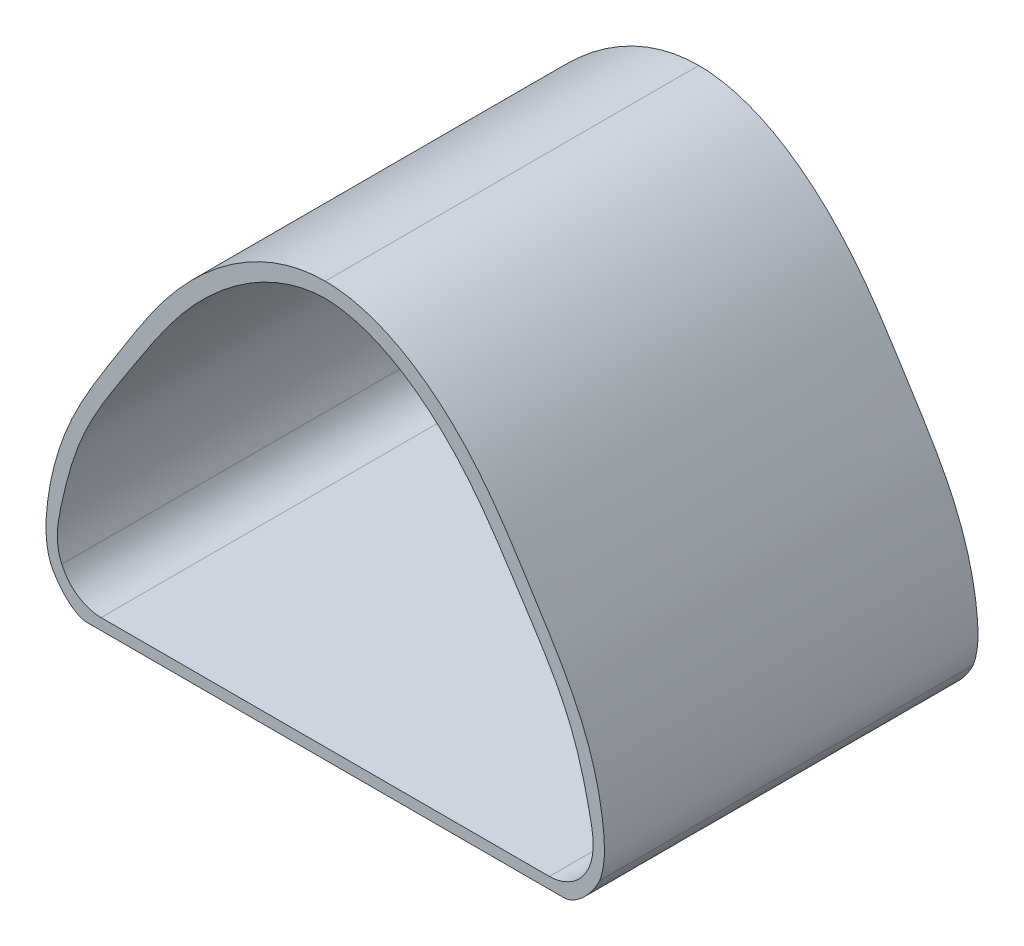
ISO-10303-21;
HEADER;
FILE_DESCRIPTION(('STEP AP214'),'2;1');
FILE_NAME('part.step','',(''),(''),'','','');
FILE_SCHEMA(('AUTOMOTIVE_DESIGN { 1 0 10303 214 1 1 1 1 }'));
ENDSEC;
DATA;
#1=APPLICATION_CONTEXT('core data for automotive mechanical design processes');
#2=APPLICATION_PROTOCOL_DEFINITION('international standard','automotive_design',2000,#1);
#3=PRODUCT_CONTEXT('',#1,'mechanical');
#4=PRODUCT('Part','Part','',(#3));
#5=PRODUCT_RELATED_PRODUCT_CATEGORY('part','',(#4));
#6=PRODUCT_DEFINITION_FORMATION('','',#4);
#7=PRODUCT_DEFINITION_CONTEXT('part definition',#1,'design');
#8=PRODUCT_DEFINITION('design','',#6,#7);
#9=PRODUCT_DEFINITION_SHAPE('','',#8);
#10=(LENGTH_UNIT() NAMED_UNIT(*) SI_UNIT(.MILLI.,.METRE.));
#11=(NAMED_UNIT(*) PLANE_ANGLE_UNIT() SI_UNIT($,.RADIAN.));
#12=(NAMED_UNIT(*) SI_UNIT($,.STERADIAN.) SOLID_ANGLE_UNIT());
#13=UNCERTAINTY_MEASURE_WITH_UNIT(LENGTH_MEASURE(1.E-05),#10,'distance_accuracy_value','');
#14=(GEOMETRIC_REPRESENTATION_CONTEXT(3) GLOBAL_UNCERTAINTY_ASSIGNED_CONTEXT((#13)) GLOBAL_UNIT_ASSIGNED_CONTEXT((#10,
#11,#12)) REPRESENTATION_CONTEXT('',''));
#15=CARTESIAN_POINT('',(0.,0.,0.));
#16=DIRECTION('',(0.,0.,1.));
#17=DIRECTION('',(1.,0.,0.));
#18=AXIS2_PLACEMENT_3D('',#15,#16,#17);
#19=CARTESIAN_POINT('',(-26.2866131746195,14.0454252533659,50.));
#20=DIRECTION('',(0.,0.,-1.));
#21=DIRECTION('',(-1.,0.,0.));
#22=AXIS2_PLACEMENT_3D('',#19,#20,#21);
#23=PLANE('',#22);
#24=CARTESIAN_POINT('',(0.,34.,50.));
#25=CARTESIAN_POINT('',(-7.55591327936916,34.0116022680808,50.));
#26=CARTESIAN_POINT('',(-18.9599448917895,25.9336197892861,50.));
#27=CARTESIAN_POINT('',(-27.4107680639639,12.1589549208056,50.));
#28=CARTESIAN_POINT('',(-34.5056174863227,1.23156958461363,50.));
#29=CARTESIAN_POINT('',(-37.3685284127436,-8.74251736737803,50.));
#30=CARTESIAN_POINT('',(-37.5154890228837,-15.1166862360437,50.));
#31=CARTESIAN_POINT('',(-36.7339095421751,-17.1293033334891,50.));
#32=B_SPLINE_CURVE_WITH_KNOTS('',3,(#24,#25,#26,#27,#28,#29,#30,#31),.UNSPECIFIED.,.F.,.F.,(4,1,
1,1,1,4),(0.,0.330857753427656,0.539322828956454,0.730827311197381,0.902654757311437,1.),.UNSPECIFIED.);
#33=CARTESIAN_POINT('',(0.,34.,50.));
#34=VERTEX_POINT('',#33);
#35=CARTESIAN_POINT('',(-36.7339095421751,-17.1293033334891,50.));
#36=VERTEX_POINT('',#35);
#37=EDGE_CURVE('E230',#34,#36,#32,.T.);
#38=ORIENTED_EDGE('',*,*,#37,.T.);
#39=CARTESIAN_POINT('',(-36.7339095421751,-17.1293033334891,50.));
#40=CARTESIAN_POINT('',(-36.4427084578611,-17.7892932581863,50.));
#41=CARTESIAN_POINT('',(-35.0930030724469,-20.0354093422505,50.));
#42=CARTESIAN_POINT('',(-32.8599028306378,-21.4830955631931,50.));
#43=CARTESIAN_POINT('',(-32.,-21.5,50.));
#44=B_SPLINE_CURVE_WITH_KNOTS('',3,(#39,#40,#41,#42,#43),.UNSPECIFIED.,.F.,.F.,(4,1,4),(0.,
0.489167663006453,1.),.UNSPECIFIED.);
#45=CARTESIAN_POINT('',(-32.,-21.5,50.));
#46=VERTEX_POINT('',#45);
#47=EDGE_CURVE('E268',#36,#46,#44,.T.);
#48=ORIENTED_EDGE('',*,*,#47,.T.);
#49=DIRECTION('',(1.,0.,0.));
#50=VECTOR('',#49,1.);
#51=CARTESIAN_POINT('',(-32.,-21.5,50.));
#52=LINE('',#51,#50);
#53=CARTESIAN_POINT('',(32.,-21.5,50.));
#54=VERTEX_POINT('',#53);
#55=EDGE_CURVE('E252',#46,#54,#52,.T.);
#56=ORIENTED_EDGE('',*,*,#55,.T.);
#57=CARTESIAN_POINT('',(32.,-21.5,50.));
#58=CARTESIAN_POINT('',(32.8599028306378,-21.4830955631931,50.));
#59=CARTESIAN_POINT('',(35.0930030724469,-20.0354093422505,50.));
#60=CARTESIAN_POINT('',(36.4427084578611,-17.7892932581863,50.));
#61=CARTESIAN_POINT('',(36.7339095421751,-17.1293033334891,50.));
#62=B_SPLINE_CURVE_WITH_KNOTS('',3,(#57,#58,#59,#60,#61),.UNSPECIFIED.,.F.,.F.,(4,1,4),(0.,
0.510832336993547,1.),.UNSPECIFIED.);
#63=CARTESIAN_POINT('',(36.7339095421751,-17.1293033334891,50.));
#64=VERTEX_POINT('',#63);
#65=EDGE_CURVE('E190',#54,#64,#62,.T.);
#66=ORIENTED_EDGE('',*,*,#65,.T.);
#67=CARTESIAN_POINT('',(36.7339095421751,-17.1293033334891,50.));
#68=CARTESIAN_POINT('',(37.5154890228837,-15.1166862360437,50.));
#69=CARTESIAN_POINT('',(37.3685284127436,-8.74251736737802,50.));
#70=CARTESIAN_POINT('',(34.5056174863227,1.23156958461364,50.));
#71=CARTESIAN_POINT('',(27.4107680639639,12.1589549208056,50.));
#72=CARTESIAN_POINT('',(18.9599448917895,25.933619789286,50.));
#73=CARTESIAN_POINT('',(7.55591327936915,34.0116022680808,50.));
#74=CARTESIAN_POINT('',(0.,34.,50.));
#75=B_SPLINE_CURVE_WITH_KNOTS('',3,(#67,#68,#69,#70,#71,#72,#73,#74),.UNSPECIFIED.,.F.,.F.,(4,1,
1,1,1,4),(0.,0.0973452426885626,0.269172688802619,0.460677171043546,0.669142246572344,1.),.UNSPECIFIED.);
#76=EDGE_CURVE('E183',#64,#34,#75,.T.);
#77=ORIENTED_EDGE('',*,*,#76,.T.);
#78=EDGE_LOOP('',(#38,#48,#56,#66,#77));
#79=FACE_BOUND('',#78,.T.);
#80=CARTESIAN_POINT('',(35.2584368437434,-16.4412791148118,50.));
#81=CARTESIAN_POINT('',(36.2300611856856,-14.2120162556952,50.));
#82=CARTESIAN_POINT('',(35.2635909123545,-8.86453883683733,50.));
#83=CARTESIAN_POINT('',(32.7911731615511,0.606888672938725,50.));
#84=CARTESIAN_POINT('',(25.7176322990285,11.1374464392121,50.));
#85=CARTESIAN_POINT('',(17.5035133605746,24.3306932764224,50.));
#86=CARTESIAN_POINT('',(6.52553134181208,31.9035956706368,50.));
#87=CARTESIAN_POINT('',(0.,32.,50.));
#88=B_SPLINE_CURVE_WITH_KNOTS('',3,(#80,#81,#82,#83,#84,#85,#86,#87),.UNSPECIFIED.,.F.,.F.,(4,1,
1,1,1,4),(0.,0.101815778200956,0.254593468675808,0.456472378289915,0.689238128462499,1.),.UNSPECIFIED.);
#89=CARTESIAN_POINT('',(35.2584368437434,-16.4412791148118,50.));
#90=VERTEX_POINT('',#89);
#91=CARTESIAN_POINT('',(0.,32.,50.));
#92=VERTEX_POINT('',#91);
#93=EDGE_CURVE('E118',#90,#92,#88,.T.);
#94=ORIENTED_EDGE('',*,*,#93,.F.);
#95=CARTESIAN_POINT('',(30.,-20.,50.));
#96=CARTESIAN_POINT('',(31.1853546864803,-20.0293160233538,50.));
#97=CARTESIAN_POINT('',(33.6905561455173,-19.1425610901067,50.));
#98=CARTESIAN_POINT('',(34.9964434209078,-17.0209088515704,50.));
#99=CARTESIAN_POINT('',(35.2584368437434,-16.4412791148118,50.));
#100=B_SPLINE_CURVE_WITH_KNOTS('',3,(#95,#96,#97,#98,#99),.UNSPECIFIED.,.F.,.F.,(4,1,4),(0.,
0.640099303613698,1.),.UNSPECIFIED.);
#101=CARTESIAN_POINT('',(30.,-20.,50.));
#102=VERTEX_POINT('',#101);
#103=EDGE_CURVE('E376',#102,#90,#100,.T.);
#104=ORIENTED_EDGE('',*,*,#103,.F.);
#105=DIRECTION('',(1.,0.,0.));
#106=VECTOR('',#105,1.);
#107=CARTESIAN_POINT('',(-30.,-20.,50.));
#108=LINE('',#107,#106);
#109=CARTESIAN_POINT('',(-30.,-20.,50.));
#110=VERTEX_POINT('',#109);
#111=EDGE_CURVE('E145',#110,#102,#108,.T.);
#112=ORIENTED_EDGE('',*,*,#111,.F.);
#113=CARTESIAN_POINT('',(-35.2584368437434,-16.4412791148118,50.));
#114=CARTESIAN_POINT('',(-34.9964434209078,-17.0209088515704,50.));
#115=CARTESIAN_POINT('',(-33.6905561455173,-19.1425610901067,50.));
#116=CARTESIAN_POINT('',(-31.1853546864803,-20.0293160233538,50.));
#117=CARTESIAN_POINT('',(-30.,-20.,50.));
#118=B_SPLINE_CURVE_WITH_KNOTS('',3,(#113,#114,#115,#116,#117),.UNSPECIFIED.,.F.,.F.,(4,1,4),
(0.,0.359900696386302,1.),.UNSPECIFIED.);
#119=CARTESIAN_POINT('',(-35.2584368437434,-16.4412791148118,50.));
#120=VERTEX_POINT('',#119);
#121=EDGE_CURVE('E141',#120,#110,#118,.T.);
#122=ORIENTED_EDGE('',*,*,#121,.F.);
#123=CARTESIAN_POINT('',(0.,32.,50.));
#124=CARTESIAN_POINT('',(-6.52553134181209,31.9035956706368,50.));
#125=CARTESIAN_POINT('',(-17.5035133605746,24.3306932764224,50.));
#126=CARTESIAN_POINT('',(-25.7176322990285,11.1374464392121,50.));
#127=CARTESIAN_POINT('',(-32.7911731615511,0.60688867293871,50.));
#128=CARTESIAN_POINT('',(-35.2635909123545,-8.86453883683735,50.));
#129=CARTESIAN_POINT('',(-36.2300611856856,-14.2120162556952,50.));
#130=CARTESIAN_POINT('',(-35.2584368437434,-16.4412791148118,50.));
#131=B_SPLINE_CURVE_WITH_KNOTS('',3,(#123,#124,#125,#126,#127,#128,#129,#130),.UNSPECIFIED.,.F.,
.F.,(4,1,1,1,1,4),(0.,0.310761871537501,0.543527621710084,0.745406531324192,0.898184221799044,
1.),.UNSPECIFIED.);
#132=EDGE_CURVE('E127',#92,#120,#131,.T.);
#133=ORIENTED_EDGE('',*,*,#132,.F.);
#134=EDGE_LOOP('',(#94,#104,#112,#122,#133));
#135=FACE_BOUND('',#134,.T.);
#136=ADVANCED_FACE('F39',(#79,#135),#23,.F.);
#137=CARTESIAN_POINT('',(-26.2866131746195,14.0454252533659,0.));
#138=DIRECTION('',(0.,0.,-1.));
#139=DIRECTION('',(-1.,0.,0.));
#140=AXIS2_PLACEMENT_3D('',#137,#138,#139);
#141=PLANE('',#140);
#142=CARTESIAN_POINT('',(0.,34.,0.));
#143=CARTESIAN_POINT('',(-7.55591327936916,34.0116022680808,0.));
#144=CARTESIAN_POINT('',(-18.9599448917895,25.9336197892861,0.));
#145=CARTESIAN_POINT('',(-27.4107680639639,12.1589549208056,0.));
#146=CARTESIAN_POINT('',(-34.5056174863227,1.23156958461363,0.));
#147=CARTESIAN_POINT('',(-37.3685284127436,-8.74251736737803,0.));
#148=CARTESIAN_POINT('',(-37.5154890228837,-15.1166862360437,0.));
#149=CARTESIAN_POINT('',(-36.7339095421751,-17.1293033334891,0.));
#150=B_SPLINE_CURVE_WITH_KNOTS('',3,(#142,#143,#144,#145,#146,#147,#148,#149),.UNSPECIFIED.,.F.,
.F.,(4,1,1,1,1,4),(0.,0.330857753427656,0.539322828956454,0.730827311197381,0.902654757311437,
1.),.UNSPECIFIED.);
#151=CARTESIAN_POINT('',(0.,34.,0.));
#152=VERTEX_POINT('',#151);
#153=CARTESIAN_POINT('',(-36.7339095421751,-17.1293033334891,0.));
#154=VERTEX_POINT('',#153);
#155=EDGE_CURVE('E136',#152,#154,#150,.T.);
#156=ORIENTED_EDGE('',*,*,#155,.F.);
#157=CARTESIAN_POINT('',(36.7339095421751,-17.1293033334891,0.));
#158=CARTESIAN_POINT('',(37.5154890228837,-15.1166862360437,0.));
#159=CARTESIAN_POINT('',(37.3685284127436,-8.74251736737802,0.));
#160=CARTESIAN_POINT('',(34.5056174863227,1.23156958461364,0.));
#161=CARTESIAN_POINT('',(27.4107680639639,12.1589549208056,0.));
#162=CARTESIAN_POINT('',(18.9599448917895,25.933619789286,0.));
#163=CARTESIAN_POINT('',(7.55591327936915,34.0116022680808,0.));
#164=CARTESIAN_POINT('',(0.,34.,0.));
#165=B_SPLINE_CURVE_WITH_KNOTS('',3,(#157,#158,#159,#160,#161,#162,#163,#164),.UNSPECIFIED.,.F.,
.F.,(4,1,1,1,1,4),(0.,0.0973452426885626,0.269172688802619,0.460677171043546,0.669142246572344,
1.),.UNSPECIFIED.);
#166=CARTESIAN_POINT('',(36.7339095421751,-17.1293033334891,0.));
#167=VERTEX_POINT('',#166);
#168=EDGE_CURVE('E222',#167,#152,#165,.T.);
#169=ORIENTED_EDGE('',*,*,#168,.F.);
#170=CARTESIAN_POINT('',(32.,-21.5,0.));
#171=CARTESIAN_POINT('',(32.8599028306378,-21.4830955631931,0.));
#172=CARTESIAN_POINT('',(35.0930030724469,-20.0354093422505,0.));
#173=CARTESIAN_POINT('',(36.4427084578611,-17.7892932581863,0.));
#174=CARTESIAN_POINT('',(36.7339095421751,-17.1293033334891,0.));
#175=B_SPLINE_CURVE_WITH_KNOTS('',3,(#170,#171,#172,#173,#174),.UNSPECIFIED.,.F.,.F.,(4,1,4),
(0.,0.510832336993547,1.),.UNSPECIFIED.);
#176=CARTESIAN_POINT('',(32.,-21.5,0.));
#177=VERTEX_POINT('',#176);
#178=EDGE_CURVE('E217',#177,#167,#175,.T.);
#179=ORIENTED_EDGE('',*,*,#178,.F.);
#180=DIRECTION('',(1.,0.,0.));
#181=VECTOR('',#180,1.);
#182=CARTESIAN_POINT('',(-32.,-21.5,0.));
#183=LINE('',#182,#181);
#184=CARTESIAN_POINT('',(-32.,-21.5,0.));
#185=VERTEX_POINT('',#184);
#186=EDGE_CURVE('E211',#185,#177,#183,.T.);
#187=ORIENTED_EDGE('',*,*,#186,.F.);
#188=CARTESIAN_POINT('',(-36.7339095421751,-17.1293033334891,0.));
#189=CARTESIAN_POINT('',(-36.4427084578611,-17.7892932581863,0.));
#190=CARTESIAN_POINT('',(-35.0930030724469,-20.0354093422505,0.));
#191=CARTESIAN_POINT('',(-32.8599028306378,-21.4830955631931,0.));
#192=CARTESIAN_POINT('',(-32.,-21.5,0.));
#193=B_SPLINE_CURVE_WITH_KNOTS('',3,(#188,#189,#190,#191,#192),.UNSPECIFIED.,.F.,.F.,(4,1,4),
(0.,0.489167663006453,1.),.UNSPECIFIED.);
#194=EDGE_CURVE('E203',#154,#185,#193,.T.);
#195=ORIENTED_EDGE('',*,*,#194,.F.);
#196=EDGE_LOOP('',(#156,#169,#179,#187,#195));
#197=FACE_BOUND('',#196,.T.);
#198=CARTESIAN_POINT('',(30.,-20.,0.));
#199=CARTESIAN_POINT('',(31.1853546864803,-20.0293160233538,0.));
#200=CARTESIAN_POINT('',(33.6905561455173,-19.1425610901067,0.));
#201=CARTESIAN_POINT('',(34.9964434209078,-17.0209088515704,0.));
#202=CARTESIAN_POINT('',(35.2584368437434,-16.4412791148118,0.));
#203=B_SPLINE_CURVE_WITH_KNOTS('',3,(#198,#199,#200,#201,#202),.UNSPECIFIED.,.F.,.F.,(4,1,4),
(0.,0.640099303613698,1.),.UNSPECIFIED.);
#204=CARTESIAN_POINT('',(30.,-20.,0.));
#205=VERTEX_POINT('',#204);
#206=CARTESIAN_POINT('',(35.2584368437434,-16.4412791148118,0.));
#207=VERTEX_POINT('',#206);
#208=EDGE_CURVE('E128',#205,#207,#203,.T.);
#209=ORIENTED_EDGE('',*,*,#208,.T.);
#210=CARTESIAN_POINT('',(35.2584368437434,-16.4412791148118,0.));
#211=CARTESIAN_POINT('',(36.2300611856856,-14.2120162556952,0.));
#212=CARTESIAN_POINT('',(35.2635909123545,-8.86453883683733,0.));
#213=CARTESIAN_POINT('',(32.7911731615511,0.606888672938725,0.));
#214=CARTESIAN_POINT('',(25.7176322990285,11.1374464392121,0.));
#215=CARTESIAN_POINT('',(17.5035133605746,24.3306932764224,0.));
#216=CARTESIAN_POINT('',(6.52553134181208,31.9035956706368,0.));
#217=CARTESIAN_POINT('',(0.,32.,0.));
#218=B_SPLINE_CURVE_WITH_KNOTS('',3,(#210,#211,#212,#213,#214,#215,#216,#217),.UNSPECIFIED.,.F.,
.F.,(4,1,1,1,1,4),(0.,0.101815778200956,0.254593468675808,0.456472378289915,0.689238128462499,
1.),.UNSPECIFIED.);
#219=CARTESIAN_POINT('',(0.,32.,0.));
#220=VERTEX_POINT('',#219);
#221=EDGE_CURVE('E64',#207,#220,#218,.T.);
#222=ORIENTED_EDGE('',*,*,#221,.T.);
#223=CARTESIAN_POINT('',(0.,32.,0.));
#224=CARTESIAN_POINT('',(-6.52553134181209,31.9035956706368,0.));
#225=CARTESIAN_POINT('',(-17.5035133605746,24.3306932764224,0.));
#226=CARTESIAN_POINT('',(-25.7176322990285,11.1374464392121,0.));
#227=CARTESIAN_POINT('',(-32.7911731615511,0.60688867293871,0.));
#228=CARTESIAN_POINT('',(-35.2635909123545,-8.86453883683735,0.));
#229=CARTESIAN_POINT('',(-36.2300611856856,-14.2120162556952,0.));
#230=CARTESIAN_POINT('',(-35.2584368437434,-16.4412791148118,0.));
#231=B_SPLINE_CURVE_WITH_KNOTS('',3,(#223,#224,#225,#226,#227,#228,#229,#230),.UNSPECIFIED.,.F.,
.F.,(4,1,1,1,1,4),(0.,0.310761871537501,0.543527621710084,0.745406531324192,0.898184221799044,
1.),.UNSPECIFIED.);
#232=CARTESIAN_POINT('',(-35.2584368437434,-16.4412791148118,0.));
#233=VERTEX_POINT('',#232);
#234=EDGE_CURVE('E134',#220,#233,#231,.T.);
#235=ORIENTED_EDGE('',*,*,#234,.T.);
#236=CARTESIAN_POINT('',(-35.2584368437434,-16.4412791148118,0.));
#237=CARTESIAN_POINT('',(-34.9964434209078,-17.0209088515704,0.));
#238=CARTESIAN_POINT('',(-33.6905561455173,-19.1425610901067,0.));
#239=CARTESIAN_POINT('',(-31.1853546864803,-20.0293160233538,0.));
#240=CARTESIAN_POINT('',(-30.,-20.,0.));
#241=B_SPLINE_CURVE_WITH_KNOTS('',3,(#236,#237,#238,#239,#240),.UNSPECIFIED.,.F.,.F.,(4,1,4),
(0.,0.359900696386302,1.),.UNSPECIFIED.);
#242=CARTESIAN_POINT('',(-30.,-20.,0.));
#243=VERTEX_POINT('',#242);
#244=EDGE_CURVE('E399',#233,#243,#241,.T.);
#245=ORIENTED_EDGE('',*,*,#244,.T.);
#246=DIRECTION('',(1.,0.,0.));
#247=VECTOR('',#246,1.);
#248=CARTESIAN_POINT('',(-30.,-20.,0.));
#249=LINE('',#248,#247);
#250=EDGE_CURVE('E408',#243,#205,#249,.T.);
#251=ORIENTED_EDGE('',*,*,#250,.T.);
#252=EDGE_LOOP('',(#209,#222,#235,#245,#251));
#253=FACE_BOUND('',#252,.T.);
#254=ADVANCED_FACE('F171',(#197,#253),#141,.T.);
#255=DIRECTION('',(0.,0.,-1.));
#256=VECTOR('',#255,1.);
#257=SURFACE_OF_LINEAR_EXTRUSION('',#32,#256);
#258=ORIENTED_EDGE('',*,*,#155,.T.);
#259=DIRECTION('',(0.,0.,-1.));
#260=VECTOR('',#259,1.);
#261=CARTESIAN_POINT('',(-36.7339095421751,-17.1293033334891,50.));
#262=LINE('',#261,#260);
#263=EDGE_CURVE('E11',#36,#154,#262,.T.);
#264=ORIENTED_EDGE('',*,*,#263,.F.);
#265=ORIENTED_EDGE('',*,*,#37,.F.);
#266=DIRECTION('',(0.,0.,-1.));
#267=VECTOR('',#266,1.);
#268=CARTESIAN_POINT('',(0.,34.,50.));
#269=LINE('',#268,#267);
#270=EDGE_CURVE('E189',#34,#152,#269,.T.);
#271=ORIENTED_EDGE('',*,*,#270,.T.);
#272=EDGE_LOOP('',(#258,#264,#265,#271));
#273=FACE_BOUND('',#272,.T.);
#274=ADVANCED_FACE('F41',(#273),#257,.F.);
#275=DIRECTION('',(0.,0.,-1.));
#276=VECTOR('',#275,1.);
#277=SURFACE_OF_LINEAR_EXTRUSION('',#44,#276);
#278=ORIENTED_EDGE('',*,*,#194,.T.);
#279=DIRECTION('',(0.,0.,-1.));
#280=VECTOR('',#279,1.);
#281=CARTESIAN_POINT('',(-32.,-21.5,50.));
#282=LINE('',#281,#280);
#283=EDGE_CURVE('E49',#46,#185,#282,.T.);
#284=ORIENTED_EDGE('',*,*,#283,.F.);
#285=ORIENTED_EDGE('',*,*,#47,.F.);
#286=ORIENTED_EDGE('',*,*,#263,.T.);
#287=EDGE_LOOP('',(#278,#284,#285,#286));
#288=FACE_BOUND('',#287,.T.);
#289=ADVANCED_FACE('F280',(#288),#277,.F.);
#290=CARTESIAN_POINT('',(-32.,-21.5,50.));
#291=DIRECTION('',(0.,1.,0.));
#292=DIRECTION('',(-1.,0.,0.));
#293=AXIS2_PLACEMENT_3D('',#290,#291,#292);
#294=PLANE('',#293);
#295=ORIENTED_EDGE('',*,*,#186,.T.);
#296=DIRECTION('',(0.,0.,-1.));
#297=VECTOR('',#296,1.);
#298=CARTESIAN_POINT('',(32.,-21.5,50.));
#299=LINE('',#298,#297);
#300=EDGE_CURVE('E241',#54,#177,#299,.T.);
#301=ORIENTED_EDGE('',*,*,#300,.F.);
#302=ORIENTED_EDGE('',*,*,#55,.F.);
#303=ORIENTED_EDGE('',*,*,#283,.T.);
#304=EDGE_LOOP('',(#295,#301,#302,#303));
#305=FACE_BOUND('',#304,.T.);
#306=ADVANCED_FACE('F250',(#305),#294,.F.);
#307=DIRECTION('',(0.,0.,-1.));
#308=VECTOR('',#307,1.);
#309=SURFACE_OF_LINEAR_EXTRUSION('',#62,#308);
#310=ORIENTED_EDGE('',*,*,#178,.T.);
#311=DIRECTION('',(0.,0.,-1.));
#312=VECTOR('',#311,1.);
#313=CARTESIAN_POINT('',(36.7339095421751,-17.1293033334891,50.));
#314=LINE('',#313,#312);
#315=EDGE_CURVE('E237',#64,#167,#314,.T.);
#316=ORIENTED_EDGE('',*,*,#315,.F.);
#317=ORIENTED_EDGE('',*,*,#65,.F.);
#318=ORIENTED_EDGE('',*,*,#300,.T.);
#319=EDGE_LOOP('',(#310,#316,#317,#318));
#320=FACE_BOUND('',#319,.T.);
#321=ADVANCED_FACE('F179',(#320),#309,.F.);
#322=DIRECTION('',(0.,0.,-1.));
#323=VECTOR('',#322,1.);
#324=SURFACE_OF_LINEAR_EXTRUSION('',#75,#323);
#325=ORIENTED_EDGE('',*,*,#168,.T.);
#326=ORIENTED_EDGE('',*,*,#270,.F.);
#327=ORIENTED_EDGE('',*,*,#76,.F.);
#328=ORIENTED_EDGE('',*,*,#315,.T.);
#329=EDGE_LOOP('',(#325,#326,#327,#328));
#330=FACE_BOUND('',#329,.T.);
#331=ADVANCED_FACE('F168',(#330),#324,.F.);
#332=DIRECTION('',(0.,0.,-1.));
#333=VECTOR('',#332,1.);
#334=SURFACE_OF_LINEAR_EXTRUSION('',#88,#333);
#335=ORIENTED_EDGE('',*,*,#221,.F.);
#336=DIRECTION('',(0.,0.,-1.));
#337=VECTOR('',#336,1.);
#338=CARTESIAN_POINT('',(35.2584368437434,-16.4412791148118,50.));
#339=LINE('',#338,#337);
#340=EDGE_CURVE('E122',#90,#207,#339,.T.);
#341=ORIENTED_EDGE('',*,*,#340,.F.);
#342=ORIENTED_EDGE('',*,*,#93,.T.);
#343=DIRECTION('',(0.,0.,-1.));
#344=VECTOR('',#343,1.);
#345=CARTESIAN_POINT('',(0.,32.,50.));
#346=LINE('',#345,#344);
#347=EDGE_CURVE('E121',#92,#220,#346,.T.);
#348=ORIENTED_EDGE('',*,*,#347,.T.);
#349=EDGE_LOOP('',(#335,#341,#342,#348));
#350=FACE_BOUND('',#349,.T.);
#351=ADVANCED_FACE('F120',(#350),#334,.T.);
#352=DIRECTION('',(0.,0.,-1.));
#353=VECTOR('',#352,1.);
#354=SURFACE_OF_LINEAR_EXTRUSION('',#131,#353);
#355=ORIENTED_EDGE('',*,*,#234,.F.);
#356=ORIENTED_EDGE('',*,*,#347,.F.);
#357=ORIENTED_EDGE('',*,*,#132,.T.);
#358=DIRECTION('',(0.,0.,-1.));
#359=VECTOR('',#358,1.);
#360=CARTESIAN_POINT('',(-35.2584368437434,-16.4412791148118,50.));
#361=LINE('',#360,#359);
#362=EDGE_CURVE('E137',#120,#233,#361,.T.);
#363=ORIENTED_EDGE('',*,*,#362,.T.);
#364=EDGE_LOOP('',(#355,#356,#357,#363));
#365=FACE_BOUND('',#364,.T.);
#366=ADVANCED_FACE('F131',(#365),#354,.T.);
#367=DIRECTION('',(0.,0.,-1.));
#368=VECTOR('',#367,1.);
#369=SURFACE_OF_LINEAR_EXTRUSION('',#118,#368);
#370=ORIENTED_EDGE('',*,*,#244,.F.);
#371=ORIENTED_EDGE('',*,*,#362,.F.);
#372=ORIENTED_EDGE('',*,*,#121,.T.);
#373=DIRECTION('',(0.,0.,-1.));
#374=VECTOR('',#373,1.);
#375=CARTESIAN_POINT('',(-30.,-20.,50.));
#376=LINE('',#375,#374);
#377=EDGE_CURVE('E369',#110,#243,#376,.T.);
#378=ORIENTED_EDGE('',*,*,#377,.T.);
#379=EDGE_LOOP('',(#370,#371,#372,#378));
#380=FACE_BOUND('',#379,.T.);
#381=ADVANCED_FACE('F164',(#380),#369,.T.);
#382=CARTESIAN_POINT('',(-30.,-20.,50.));
#383=DIRECTION('',(0.,1.,0.));
#384=DIRECTION('',(-1.,0.,0.));
#385=AXIS2_PLACEMENT_3D('',#382,#383,#384);
#386=PLANE('',#385);
#387=ORIENTED_EDGE('',*,*,#250,.F.);
#388=ORIENTED_EDGE('',*,*,#377,.F.);
#389=ORIENTED_EDGE('',*,*,#111,.T.);
#390=DIRECTION('',(0.,0.,-1.));
#391=VECTOR('',#390,1.);
#392=CARTESIAN_POINT('',(30.,-20.,50.));
#393=LINE('',#392,#391);
#394=EDGE_CURVE('E56',#102,#205,#393,.T.);
#395=ORIENTED_EDGE('',*,*,#394,.T.);
#396=EDGE_LOOP('',(#387,#388,#389,#395));
#397=FACE_BOUND('',#396,.T.);
#398=ADVANCED_FACE('F306',(#397),#386,.T.);
#399=DIRECTION('',(0.,0.,-1.));
#400=VECTOR('',#399,1.);
#401=SURFACE_OF_LINEAR_EXTRUSION('',#100,#400);
#402=ORIENTED_EDGE('',*,*,#208,.F.);
#403=ORIENTED_EDGE('',*,*,#394,.F.);
#404=ORIENTED_EDGE('',*,*,#103,.T.);
#405=ORIENTED_EDGE('',*,*,#340,.T.);
#406=EDGE_LOOP('',(#402,#403,#404,#405));
#407=FACE_BOUND('',#406,.T.);
#408=ADVANCED_FACE('F313',(#407),#401,.T.);
#409=CLOSED_SHELL('',(#136,#254,#274,#289,#306,#321,#331,#351,#366,#381,#398,#408));
#410=MANIFOLD_SOLID_BREP('B2',#409);
#411=ADVANCED_BREP_SHAPE_REPRESENTATION('',(#18,#410),#14);
#412=SHAPE_DEFINITION_REPRESENTATION(#9,#411);
ENDSEC;
END-ISO-10303-21;
